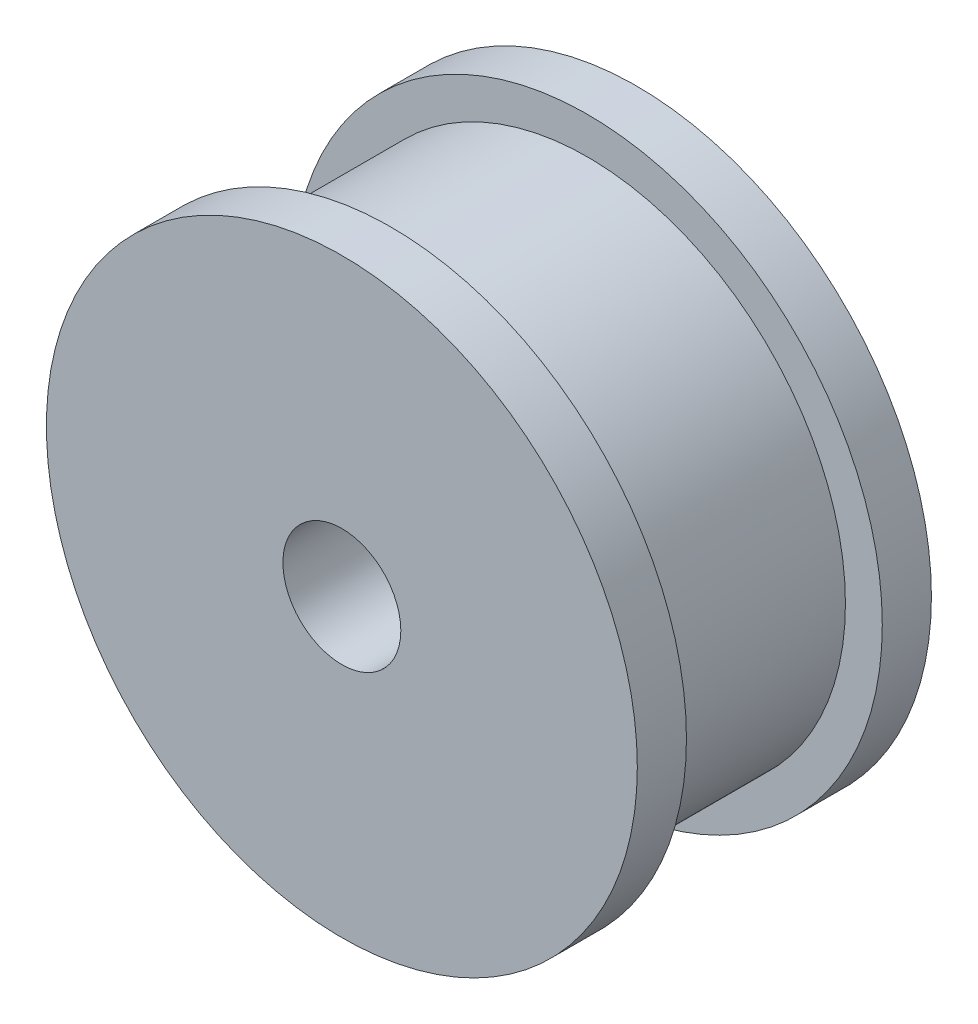
ISO-10303-21;
HEADER;
FILE_DESCRIPTION(('STEP AP214'),'2;1');
FILE_NAME('part.step','',(''),(''),'','','');
FILE_SCHEMA(('AUTOMOTIVE_DESIGN { 1 0 10303 214 1 1 1 1 }'));
ENDSEC;
DATA;
#1=APPLICATION_CONTEXT('core data for automotive mechanical design processes');
#2=APPLICATION_PROTOCOL_DEFINITION('international standard','automotive_design',2000,#1);
#3=PRODUCT_CONTEXT('',#1,'mechanical');
#4=PRODUCT('Part','Part','',(#3));
#5=PRODUCT_RELATED_PRODUCT_CATEGORY('part','',(#4));
#6=PRODUCT_DEFINITION_FORMATION('','',#4);
#7=PRODUCT_DEFINITION_CONTEXT('part definition',#1,'design');
#8=PRODUCT_DEFINITION('design','',#6,#7);
#9=PRODUCT_DEFINITION_SHAPE('','',#8);
#10=(LENGTH_UNIT() NAMED_UNIT(*) SI_UNIT(.MILLI.,.METRE.));
#11=(NAMED_UNIT(*) PLANE_ANGLE_UNIT() SI_UNIT($,.RADIAN.));
#12=(NAMED_UNIT(*) SI_UNIT($,.STERADIAN.) SOLID_ANGLE_UNIT());
#13=UNCERTAINTY_MEASURE_WITH_UNIT(LENGTH_MEASURE(1.E-05),#10,'distance_accuracy_value','');
#14=(GEOMETRIC_REPRESENTATION_CONTEXT(3) GLOBAL_UNCERTAINTY_ASSIGNED_CONTEXT((#13)) GLOBAL_UNIT_ASSIGNED_CONTEXT((#10,
#11,#12)) REPRESENTATION_CONTEXT('',''));
#15=CARTESIAN_POINT('',(0.,0.,0.));
#16=DIRECTION('',(0.,0.,1.));
#17=DIRECTION('',(1.,0.,0.));
#18=AXIS2_PLACEMENT_3D('',#15,#16,#17);
#19=CARTESIAN_POINT('',(0.,0.,8.));
#20=DIRECTION('',(0.,0.,-1.));
#21=DIRECTION('',(-1.,0.,0.));
#22=AXIS2_PLACEMENT_3D('',#19,#20,#21);
#23=CYLINDRICAL_SURFACE('',#22,10.5);
#24=CARTESIAN_POINT('',(0.,0.,8.));
#25=DIRECTION('',(0.,0.,1.));
#26=DIRECTION('',(1.,0.,0.));
#27=AXIS2_PLACEMENT_3D('',#24,#25,#26);
#28=CIRCLE('',#27,10.5);
#29=CARTESIAN_POINT('',(10.5,0.,8.));
#30=VERTEX_POINT('',#29);
#31=EDGE_CURVE('E11',#30,#30,#28,.T.);
#32=ORIENTED_EDGE('',*,*,#31,.F.);
#33=EDGE_LOOP('',(#32));
#34=FACE_BOUND('',#33,.T.);
#35=CARTESIAN_POINT('',(0.,0.,0.));
#36=DIRECTION('',(0.,0.,1.));
#37=DIRECTION('',(1.,0.,0.));
#38=AXIS2_PLACEMENT_3D('',#35,#36,#37);
#39=CIRCLE('',#38,10.5);
#40=CARTESIAN_POINT('',(10.5,0.,0.));
#41=VERTEX_POINT('',#40);
#42=EDGE_CURVE('E39',#41,#41,#39,.T.);
#43=ORIENTED_EDGE('',*,*,#42,.T.);
#44=EDGE_LOOP('',(#43));
#45=FACE_BOUND('',#44,.T.);
#46=ADVANCED_FACE('F33',(#34,#45),#23,.T.);
#47=CARTESIAN_POINT('',(0.,0.,8.));
#48=DIRECTION('',(0.,0.,-1.));
#49=DIRECTION('',(-1.,0.,0.));
#50=AXIS2_PLACEMENT_3D('',#47,#48,#49);
#51=CYLINDRICAL_SURFACE('',#50,2.4);
#52=CARTESIAN_POINT('',(0.,0.,-2.));
#53=DIRECTION('',(0.,0.,1.));
#54=DIRECTION('',(1.,0.,0.));
#55=AXIS2_PLACEMENT_3D('',#52,#53,#54);
#56=CIRCLE('',#55,2.4);
#57=CARTESIAN_POINT('',(2.4,0.,-2.));
#58=VERTEX_POINT('',#57);
#59=EDGE_CURVE('E51',#58,#58,#56,.T.);
#60=ORIENTED_EDGE('',*,*,#59,.F.);
#61=EDGE_LOOP('',(#60));
#62=FACE_BOUND('',#61,.T.);
#63=CARTESIAN_POINT('',(0.,0.,10.));
#64=DIRECTION('',(0.,0.,1.));
#65=DIRECTION('',(1.,0.,0.));
#66=AXIS2_PLACEMENT_3D('',#63,#64,#65);
#67=CIRCLE('',#66,2.4);
#68=CARTESIAN_POINT('',(2.4,0.,10.));
#69=VERTEX_POINT('',#68);
#70=EDGE_CURVE('E61',#69,#69,#67,.T.);
#71=ORIENTED_EDGE('',*,*,#70,.T.);
#72=EDGE_LOOP('',(#71));
#73=FACE_BOUND('',#72,.T.);
#74=ADVANCED_FACE('F65',(#62,#73),#51,.F.);
#75=CARTESIAN_POINT('',(0.,0.,0.));
#76=DIRECTION('',(0.,0.,1.));
#77=DIRECTION('',(1.,0.,0.));
#78=AXIS2_PLACEMENT_3D('',#75,#76,#77);
#79=PLANE('',#78);
#80=CARTESIAN_POINT('',(0.,0.,0.));
#81=DIRECTION('',(0.,0.,1.));
#82=DIRECTION('',(1.,0.,0.));
#83=AXIS2_PLACEMENT_3D('',#80,#81,#82);
#84=CIRCLE('',#83,12.);
#85=CARTESIAN_POINT('',(12.,0.,0.));
#86=VERTEX_POINT('',#85);
#87=EDGE_CURVE('E47',#86,#86,#84,.T.);
#88=ORIENTED_EDGE('',*,*,#87,.T.);
#89=EDGE_LOOP('',(#88));
#90=FACE_BOUND('',#89,.T.);
#91=ORIENTED_EDGE('',*,*,#42,.F.);
#92=EDGE_LOOP('',(#91));
#93=FACE_BOUND('',#92,.T.);
#94=ADVANCED_FACE('F89',(#90,#93),#79,.T.);
#95=CARTESIAN_POINT('',(0.,0.,-2.));
#96=DIRECTION('',(0.,0.,1.));
#97=DIRECTION('',(1.,0.,0.));
#98=AXIS2_PLACEMENT_3D('',#95,#96,#97);
#99=CYLINDRICAL_SURFACE('',#98,12.);
#100=CARTESIAN_POINT('',(0.,0.,-2.));
#101=DIRECTION('',(0.,0.,1.));
#102=DIRECTION('',(1.,0.,0.));
#103=AXIS2_PLACEMENT_3D('',#100,#101,#102);
#104=CIRCLE('',#103,12.);
#105=CARTESIAN_POINT('',(12.,0.,-2.));
#106=VERTEX_POINT('',#105);
#107=EDGE_CURVE('E43',#106,#106,#104,.T.);
#108=ORIENTED_EDGE('',*,*,#107,.T.);
#109=EDGE_LOOP('',(#108));
#110=FACE_BOUND('',#109,.T.);
#111=ORIENTED_EDGE('',*,*,#87,.F.);
#112=EDGE_LOOP('',(#111));
#113=FACE_BOUND('',#112,.T.);
#114=ADVANCED_FACE('F94',(#110,#113),#99,.T.);
#115=CARTESIAN_POINT('',(0.,0.,-2.));
#116=DIRECTION('',(0.,0.,1.));
#117=DIRECTION('',(1.,0.,0.));
#118=AXIS2_PLACEMENT_3D('',#115,#116,#117);
#119=PLANE('',#118);
#120=ORIENTED_EDGE('',*,*,#59,.T.);
#121=EDGE_LOOP('',(#120));
#122=FACE_BOUND('',#121,.T.);
#123=ORIENTED_EDGE('',*,*,#107,.F.);
#124=EDGE_LOOP('',(#123));
#125=FACE_BOUND('',#124,.T.);
#126=ADVANCED_FACE('F81',(#122,#125),#119,.F.);
#127=CARTESIAN_POINT('',(0.,0.,8.));
#128=DIRECTION('',(0.,0.,1.));
#129=DIRECTION('',(1.,0.,0.));
#130=AXIS2_PLACEMENT_3D('',#127,#128,#129);
#131=PLANE('',#130);
#132=CARTESIAN_POINT('',(0.,0.,8.));
#133=DIRECTION('',(0.,0.,1.));
#134=DIRECTION('',(1.,0.,0.));
#135=AXIS2_PLACEMENT_3D('',#132,#133,#134);
#136=CIRCLE('',#135,12.0278687239303);
#137=CARTESIAN_POINT('',(12.0278687239303,0.,8.));
#138=VERTEX_POINT('',#137);
#139=EDGE_CURVE('E58',#138,#138,#136,.T.);
#140=ORIENTED_EDGE('',*,*,#139,.F.);
#141=EDGE_LOOP('',(#140));
#142=FACE_BOUND('',#141,.T.);
#143=ORIENTED_EDGE('',*,*,#31,.T.);
#144=EDGE_LOOP('',(#143));
#145=FACE_BOUND('',#144,.T.);
#146=ADVANCED_FACE('F71',(#142,#145),#131,.F.);
#147=CARTESIAN_POINT('',(0.,0.,10.));
#148=DIRECTION('',(0.,0.,1.));
#149=DIRECTION('',(1.,0.,0.));
#150=AXIS2_PLACEMENT_3D('',#147,#148,#149);
#151=PLANE('',#150);
#152=ORIENTED_EDGE('',*,*,#70,.F.);
#153=EDGE_LOOP('',(#152));
#154=FACE_BOUND('',#153,.T.);
#155=CARTESIAN_POINT('',(0.,0.,10.));
#156=DIRECTION('',(0.,0.,1.));
#157=DIRECTION('',(1.,0.,0.));
#158=AXIS2_PLACEMENT_3D('',#155,#156,#157);
#159=CIRCLE('',#158,12.0278687239303);
#160=CARTESIAN_POINT('',(12.0278687239303,0.,10.));
#161=VERTEX_POINT('',#160);
#162=EDGE_CURVE('E55',#161,#161,#159,.T.);
#163=ORIENTED_EDGE('',*,*,#162,.T.);
#164=EDGE_LOOP('',(#163));
#165=FACE_BOUND('',#164,.T.);
#166=ADVANCED_FACE('F67',(#154,#165),#151,.T.);
#167=CARTESIAN_POINT('',(0.,0.,8.));
#168=DIRECTION('',(0.,0.,1.));
#169=DIRECTION('',(1.,0.,0.));
#170=AXIS2_PLACEMENT_3D('',#167,#168,#169);
#171=CYLINDRICAL_SURFACE('',#170,12.0278687239303);
#172=ORIENTED_EDGE('',*,*,#139,.T.);
#173=EDGE_LOOP('',(#172));
#174=FACE_BOUND('',#173,.T.);
#175=ORIENTED_EDGE('',*,*,#162,.F.);
#176=EDGE_LOOP('',(#175));
#177=FACE_BOUND('',#176,.T.);
#178=ADVANCED_FACE('F70',(#174,#177),#171,.T.);
#179=CLOSED_SHELL('',(#46,#74,#94,#114,#126,#146,#166,#178));
#180=MANIFOLD_SOLID_BREP('B2',#179);
#181=ADVANCED_BREP_SHAPE_REPRESENTATION('',(#18,#180),#14);
#182=SHAPE_DEFINITION_REPRESENTATION(#9,#181);
ENDSEC;
END-ISO-10303-21;
